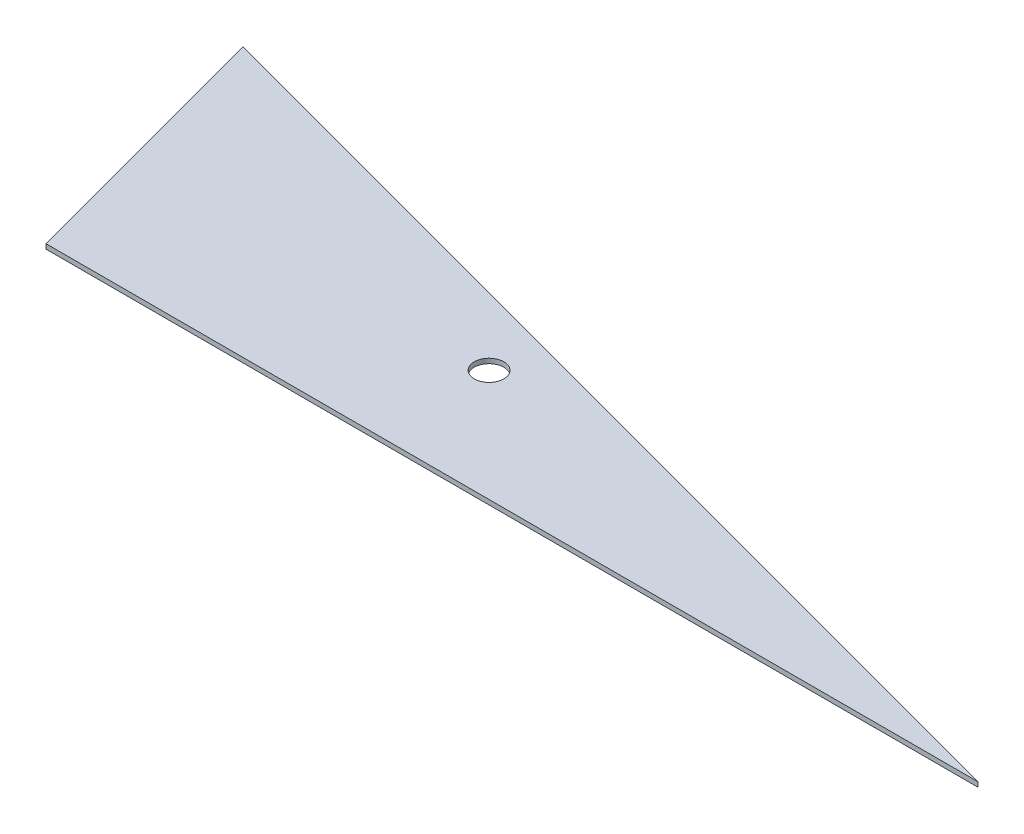
ISO-10303-21;
HEADER;
FILE_DESCRIPTION(('STEP AP214'),'2;1');
FILE_NAME('part.step','',(''),(''),'','','');
FILE_SCHEMA(('AUTOMOTIVE_DESIGN { 1 0 10303 214 1 1 1 1 }'));
ENDSEC;
DATA;
#1=APPLICATION_CONTEXT('core data for automotive mechanical design processes');
#2=APPLICATION_PROTOCOL_DEFINITION('international standard','automotive_design',2000,#1);
#3=PRODUCT_CONTEXT('',#1,'mechanical');
#4=PRODUCT('Part','Part','',(#3));
#5=PRODUCT_RELATED_PRODUCT_CATEGORY('part','',(#4));
#6=PRODUCT_DEFINITION_FORMATION('','',#4);
#7=PRODUCT_DEFINITION_CONTEXT('part definition',#1,'design');
#8=PRODUCT_DEFINITION('design','',#6,#7);
#9=PRODUCT_DEFINITION_SHAPE('','',#8);
#10=(LENGTH_UNIT() NAMED_UNIT(*) SI_UNIT(.MILLI.,.METRE.));
#11=(NAMED_UNIT(*) PLANE_ANGLE_UNIT() SI_UNIT($,.RADIAN.));
#12=(NAMED_UNIT(*) SI_UNIT($,.STERADIAN.) SOLID_ANGLE_UNIT());
#13=UNCERTAINTY_MEASURE_WITH_UNIT(LENGTH_MEASURE(1.E-05),#10,'distance_accuracy_value','');
#14=(GEOMETRIC_REPRESENTATION_CONTEXT(3) GLOBAL_UNCERTAINTY_ASSIGNED_CONTEXT((#13)) GLOBAL_UNIT_ASSIGNED_CONTEXT((#10,
#11,#12)) REPRESENTATION_CONTEXT('',''));
#15=CARTESIAN_POINT('',(0.,0.,0.));
#16=DIRECTION('',(0.,0.,1.));
#17=DIRECTION('',(1.,0.,0.));
#18=AXIS2_PLACEMENT_3D('',#15,#16,#17);
#19=CARTESIAN_POINT('',(248.915382684504,2.54,365.420521121642));
#20=DIRECTION('',(-0.258819045102514,0.,0.96592582628907));
#21=DIRECTION('',(0.96592582628907,0.,0.258819045102514));
#22=AXIS2_PLACEMENT_3D('',#19,#20,#21);
#23=PLANE('',#22);
#24=DIRECTION('',(-0.96592582628907,0.,-0.258819045102514));
#25=VECTOR('',#24,1.);
#26=CARTESIAN_POINT('',(248.915382684504,0.,365.420521121642));
#27=LINE('',#26,#25);
#28=CARTESIAN_POINT('',(248.915382684504,0.,365.420521121642));
#29=VERTEX_POINT('',#28);
#30=CARTESIAN_POINT('',(-288.635862606932,0.,221.384099055461));
#31=VERTEX_POINT('',#30);
#32=EDGE_CURVE('E85',#29,#31,#27,.T.);
#33=ORIENTED_EDGE('',*,*,#32,.T.);
#34=DIRECTION('',(0.,-1.,0.));
#35=VECTOR('',#34,1.);
#36=CARTESIAN_POINT('',(-288.635862606932,2.54,221.384099055461));
#37=LINE('',#36,#35);
#38=CARTESIAN_POINT('',(-288.635862606932,2.54,221.384099055461));
#39=VERTEX_POINT('',#38);
#40=EDGE_CURVE('E11',#39,#31,#37,.T.);
#41=ORIENTED_EDGE('',*,*,#40,.F.);
#42=DIRECTION('',(-0.96592582628907,0.,-0.258819045102514));
#43=VECTOR('',#42,1.);
#44=CARTESIAN_POINT('',(248.915382684504,2.54,365.420521121642));
#45=LINE('',#44,#43);
#46=CARTESIAN_POINT('',(248.915382684504,2.54,365.420521121642));
#47=VERTEX_POINT('',#46);
#48=EDGE_CURVE('E86',#47,#39,#45,.T.);
#49=ORIENTED_EDGE('',*,*,#48,.F.);
#50=DIRECTION('',(0.,-1.,0.));
#51=VECTOR('',#50,1.);
#52=CARTESIAN_POINT('',(248.915382684504,2.54,365.420521121642));
#53=LINE('',#52,#51);
#54=EDGE_CURVE('E45',#47,#29,#53,.T.);
#55=ORIENTED_EDGE('',*,*,#54,.T.);
#56=EDGE_LOOP('',(#33,#41,#49,#55));
#57=FACE_BOUND('',#56,.T.);
#58=ADVANCED_FACE('F37',(#57),#23,.F.);
#59=CARTESIAN_POINT('',(-288.635862606932,2.54,365.420521121642));
#60=DIRECTION('',(0.,0.,-1.));
#61=DIRECTION('',(-1.,0.,0.));
#62=AXIS2_PLACEMENT_3D('',#59,#60,#61);
#63=PLANE('',#62);
#64=DIRECTION('',(1.,0.,0.));
#65=VECTOR('',#64,1.);
#66=CARTESIAN_POINT('',(-288.635862606932,2.54,365.420521121642));
#67=LINE('',#66,#65);
#68=CARTESIAN_POINT('',(-250.041419633631,2.54,365.420521121642));
#69=VERTEX_POINT('',#68);
#70=EDGE_CURVE('E52',#69,#47,#67,.T.);
#71=ORIENTED_EDGE('',*,*,#70,.F.);
#72=DIRECTION('',(0.,-1.,0.));
#73=VECTOR('',#72,1.);
#74=CARTESIAN_POINT('',(-250.041419633631,2.54,365.420521121642));
#75=LINE('',#74,#73);
#76=CARTESIAN_POINT('',(-250.041419633631,0.,365.420521121642));
#77=VERTEX_POINT('',#76);
#78=EDGE_CURVE('E68',#69,#77,#75,.T.);
#79=ORIENTED_EDGE('',*,*,#78,.T.);
#80=DIRECTION('',(1.,0.,0.));
#81=VECTOR('',#80,1.);
#82=CARTESIAN_POINT('',(-288.635862606932,0.,365.420521121642));
#83=LINE('',#82,#81);
#84=EDGE_CURVE('E80',#77,#29,#83,.T.);
#85=ORIENTED_EDGE('',*,*,#84,.T.);
#86=ORIENTED_EDGE('',*,*,#54,.F.);
#87=EDGE_LOOP('',(#71,#79,#85,#86));
#88=FACE_BOUND('',#87,.T.);
#89=ADVANCED_FACE('F79',(#88),#63,.F.);
#90=CARTESIAN_POINT('',(0.,2.54,0.));
#91=DIRECTION('',(0.,1.,0.));
#92=DIRECTION('',(0.,0.,1.));
#93=AXIS2_PLACEMENT_3D('',#90,#91,#92);
#94=PLANE('',#93);
#95=DIRECTION('',(0.258819045102514,0.,0.96592582628907));
#96=VECTOR('',#95,1.);
#97=CARTESIAN_POINT('',(-288.635862606932,2.54,221.384099055461));
#98=LINE('',#97,#96);
#99=EDGE_CURVE('E70',#39,#69,#98,.T.);
#100=ORIENTED_EDGE('',*,*,#99,.T.);
#101=ORIENTED_EDGE('',*,*,#70,.T.);
#102=ORIENTED_EDGE('',*,*,#48,.T.);
#103=EDGE_LOOP('',(#100,#101,#102));
#104=FACE_BOUND('',#103,.T.);
#105=CARTESIAN_POINT('',(-72.7358626069316,2.54,305.530344683755));
#106=DIRECTION('',(0.,1.,0.));
#107=DIRECTION('',(0.,0.,1.));
#108=AXIS2_PLACEMENT_3D('',#105,#106,#107);
#109=CIRCLE('',#108,7.93749999999999);
#110=CARTESIAN_POINT('',(-72.7358626069316,2.54,313.467844683755));
#111=VERTEX_POINT('',#110);
#112=EDGE_CURVE('E82',#111,#111,#109,.T.);
#113=ORIENTED_EDGE('',*,*,#112,.F.);
#114=EDGE_LOOP('',(#113));
#115=FACE_BOUND('',#114,.T.);
#116=ADVANCED_FACE('F99',(#104,#115),#94,.T.);
#117=CARTESIAN_POINT('',(0.,0.,0.));
#118=DIRECTION('',(0.,1.,0.));
#119=DIRECTION('',(0.,0.,1.));
#120=AXIS2_PLACEMENT_3D('',#117,#118,#119);
#121=PLANE('',#120);
#122=CARTESIAN_POINT('',(-72.7358626069316,0.,305.530344683755));
#123=DIRECTION('',(0.,1.,0.));
#124=DIRECTION('',(0.,0.,1.));
#125=AXIS2_PLACEMENT_3D('',#122,#123,#124);
#126=CIRCLE('',#125,7.93749999999999);
#127=CARTESIAN_POINT('',(-72.7358626069316,0.,313.467844683755));
#128=VERTEX_POINT('',#127);
#129=EDGE_CURVE('E89',#128,#128,#126,.T.);
#130=ORIENTED_EDGE('',*,*,#129,.T.);
#131=EDGE_LOOP('',(#130));
#132=FACE_BOUND('',#131,.T.);
#133=ORIENTED_EDGE('',*,*,#84,.F.);
#134=DIRECTION('',(0.258819045102514,0.,0.96592582628907));
#135=VECTOR('',#134,1.);
#136=CARTESIAN_POINT('',(-288.635862606932,0.,221.384099055461));
#137=LINE('',#136,#135);
#138=EDGE_CURVE('E71',#31,#77,#137,.T.);
#139=ORIENTED_EDGE('',*,*,#138,.F.);
#140=ORIENTED_EDGE('',*,*,#32,.F.);
#141=EDGE_LOOP('',(#133,#139,#140));
#142=FACE_BOUND('',#141,.T.);
#143=ADVANCED_FACE('F84',(#132,#142),#121,.F.);
#144=CARTESIAN_POINT('',(-72.7358626069316,0.,305.530344683755));
#145=DIRECTION('',(0.,1.,0.));
#146=DIRECTION('',(0.,0.,1.));
#147=AXIS2_PLACEMENT_3D('',#144,#145,#146);
#148=CYLINDRICAL_SURFACE('',#147,7.93749999999999);
#149=ORIENTED_EDGE('',*,*,#129,.F.);
#150=EDGE_LOOP('',(#149));
#151=FACE_BOUND('',#150,.T.);
#152=ORIENTED_EDGE('',*,*,#112,.T.);
#153=EDGE_LOOP('',(#152));
#154=FACE_BOUND('',#153,.T.);
#155=ADVANCED_FACE('F111',(#151,#154),#148,.F.);
#156=CARTESIAN_POINT('',(-288.635862606932,2.54,221.384099055461));
#157=DIRECTION('',(0.96592582628907,0.,-0.258819045102514));
#158=DIRECTION('',(-0.258819045102514,0.,-0.96592582628907));
#159=AXIS2_PLACEMENT_3D('',#156,#157,#158);
#160=PLANE('',#159);
#161=ORIENTED_EDGE('',*,*,#138,.T.);
#162=ORIENTED_EDGE('',*,*,#78,.F.);
#163=ORIENTED_EDGE('',*,*,#99,.F.);
#164=ORIENTED_EDGE('',*,*,#40,.T.);
#165=EDGE_LOOP('',(#161,#162,#163,#164));
#166=FACE_BOUND('',#165,.T.);
#167=ADVANCED_FACE('F72',(#166),#160,.F.);
#168=CLOSED_SHELL('',(#58,#89,#116,#143,#155,#167));
#169=MANIFOLD_SOLID_BREP('B2',#168);
#170=ADVANCED_BREP_SHAPE_REPRESENTATION('',(#18,#169),#14);
#171=SHAPE_DEFINITION_REPRESENTATION(#9,#170);
ENDSEC;
END-ISO-10303-21;
